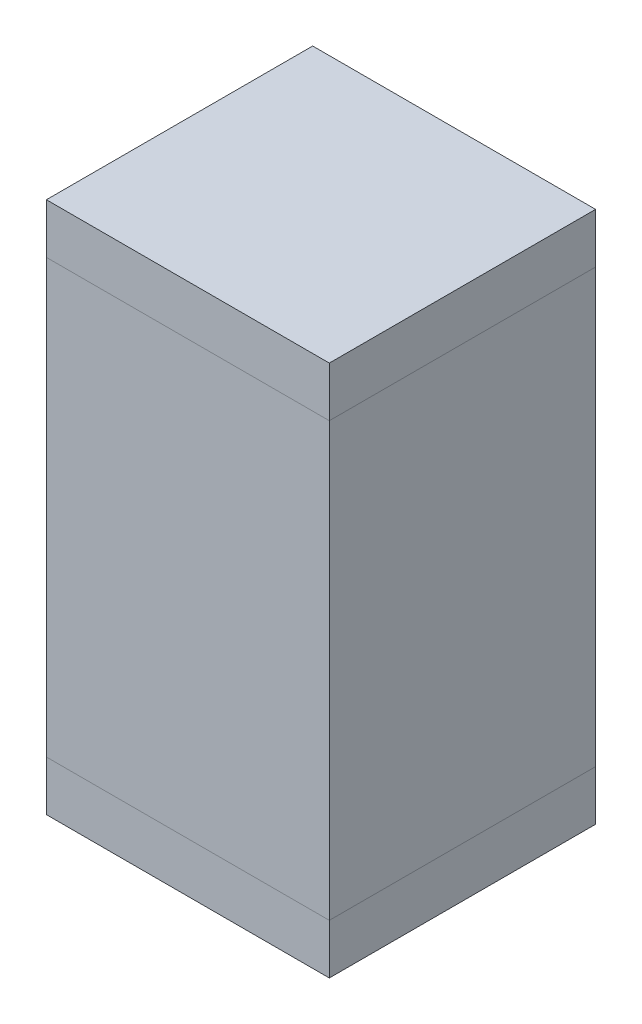
ISO-10303-21;
HEADER;
FILE_DESCRIPTION(('STEP AP214'),'2;1');
FILE_NAME('part.step','',(''),(''),'','','');
FILE_SCHEMA(('AUTOMOTIVE_DESIGN { 1 0 10303 214 1 1 1 1 }'));
ENDSEC;
DATA;
#1=APPLICATION_CONTEXT('core data for automotive mechanical design processes');
#2=APPLICATION_PROTOCOL_DEFINITION('international standard','automotive_design',2000,#1);
#3=PRODUCT_CONTEXT('',#1,'mechanical');
#4=PRODUCT('Part','Part','',(#3));
#5=PRODUCT_RELATED_PRODUCT_CATEGORY('part','',(#4));
#6=PRODUCT_DEFINITION_FORMATION('','',#4);
#7=PRODUCT_DEFINITION_CONTEXT('part definition',#1,'design');
#8=PRODUCT_DEFINITION('design','',#6,#7);
#9=PRODUCT_DEFINITION_SHAPE('','',#8);
#10=(LENGTH_UNIT() NAMED_UNIT(*) SI_UNIT(.MILLI.,.METRE.));
#11=(NAMED_UNIT(*) PLANE_ANGLE_UNIT() SI_UNIT($,.RADIAN.));
#12=(NAMED_UNIT(*) SI_UNIT($,.STERADIAN.) SOLID_ANGLE_UNIT());
#13=UNCERTAINTY_MEASURE_WITH_UNIT(LENGTH_MEASURE(1.E-05),#10,'distance_accuracy_value','');
#14=(GEOMETRIC_REPRESENTATION_CONTEXT(3) GLOBAL_UNCERTAINTY_ASSIGNED_CONTEXT((#13)) GLOBAL_UNIT_ASSIGNED_CONTEXT((#10,
#11,#12)) REPRESENTATION_CONTEXT('',''));
#15=CARTESIAN_POINT('',(0.,0.,0.));
#16=DIRECTION('',(0.,0.,1.));
#17=DIRECTION('',(1.,0.,0.));
#18=AXIS2_PLACEMENT_3D('',#15,#16,#17);
#19=CARTESIAN_POINT('',(0.,0.,0.));
#20=DIRECTION('',(0.,0.,1.));
#21=DIRECTION('',(1.,0.,0.));
#22=AXIS2_PLACEMENT_3D('',#19,#20,#21);
#23=PLANE('',#22);
#24=DIRECTION('',(1.,0.,0.));
#25=VECTOR('',#24,1.);
#26=CARTESIAN_POINT('',(-0.425,0.65,0.));
#27=LINE('',#26,#25);
#28=CARTESIAN_POINT('',(-0.425,0.65,0.));
#29=VERTEX_POINT('',#28);
#30=CARTESIAN_POINT('',(0.425,0.65,0.));
#31=VERTEX_POINT('',#30);
#32=EDGE_CURVE('P0_E26',#29,#31,#27,.T.);
#33=ORIENTED_EDGE('',*,*,#32,.T.);
#34=DIRECTION('',(0.,-1.,0.));
#35=VECTOR('',#34,1.);
#36=CARTESIAN_POINT('',(0.425,0.65,0.));
#37=LINE('',#36,#35);
#38=CARTESIAN_POINT('',(0.425,-0.65,0.));
#39=VERTEX_POINT('',#38);
#40=EDGE_CURVE('P0_E97',#31,#39,#37,.T.);
#41=ORIENTED_EDGE('',*,*,#40,.T.);
#42=DIRECTION('',(-1.,0.,0.));
#43=VECTOR('',#42,1.);
#44=CARTESIAN_POINT('',(0.425,-0.65,0.));
#45=LINE('',#44,#43);
#46=CARTESIAN_POINT('',(-0.425,-0.65,0.));
#47=VERTEX_POINT('',#46);
#48=EDGE_CURVE('P0_E83',#39,#47,#45,.T.);
#49=ORIENTED_EDGE('',*,*,#48,.T.);
#50=DIRECTION('',(0.,1.,0.));
#51=VECTOR('',#50,1.);
#52=CARTESIAN_POINT('',(-0.425,-0.65,0.));
#53=LINE('',#52,#51);
#54=EDGE_CURVE('P0_E67',#47,#29,#53,.T.);
#55=ORIENTED_EDGE('',*,*,#54,.T.);
#56=EDGE_LOOP('',(#33,#41,#49,#55));
#57=FACE_BOUND('',#56,.T.);
#58=ADVANCED_FACE('P0_F17',(#57),#23,.F.);
#59=CARTESIAN_POINT('',(0.,0.,0.8));
#60=DIRECTION('',(0.,0.,1.));
#61=DIRECTION('',(1.,0.,0.));
#62=AXIS2_PLACEMENT_3D('',#59,#60,#61);
#63=PLANE('',#62);
#64=DIRECTION('',(-1.,0.,0.));
#65=VECTOR('',#64,1.);
#66=CARTESIAN_POINT('',(-0.425,0.65,0.8));
#67=LINE('',#66,#65);
#68=CARTESIAN_POINT('',(0.425,0.65,0.8));
#69=VERTEX_POINT('',#68);
#70=CARTESIAN_POINT('',(-0.425,0.65,0.8));
#71=VERTEX_POINT('',#70);
#72=EDGE_CURVE('P0_E11',#69,#71,#67,.T.);
#73=ORIENTED_EDGE('',*,*,#72,.T.);
#74=DIRECTION('',(0.,-1.,0.));
#75=VECTOR('',#74,1.);
#76=CARTESIAN_POINT('',(-0.425,-0.65,0.8));
#77=LINE('',#76,#75);
#78=CARTESIAN_POINT('',(-0.425,-0.65,0.8));
#79=VERTEX_POINT('',#78);
#80=EDGE_CURVE('P0_E57',#71,#79,#77,.T.);
#81=ORIENTED_EDGE('',*,*,#80,.T.);
#82=DIRECTION('',(1.,0.,0.));
#83=VECTOR('',#82,1.);
#84=CARTESIAN_POINT('',(0.425,-0.65,0.8));
#85=LINE('',#84,#83);
#86=CARTESIAN_POINT('',(0.425,-0.65,0.8));
#87=VERTEX_POINT('',#86);
#88=EDGE_CURVE('P0_E61',#79,#87,#85,.T.);
#89=ORIENTED_EDGE('',*,*,#88,.T.);
#90=DIRECTION('',(0.,1.,0.));
#91=VECTOR('',#90,1.);
#92=CARTESIAN_POINT('',(0.425,0.65,0.8));
#93=LINE('',#92,#91);
#94=EDGE_CURVE('P0_E101',#87,#69,#93,.T.);
#95=ORIENTED_EDGE('',*,*,#94,.T.);
#96=EDGE_LOOP('',(#73,#81,#89,#95));
#97=FACE_BOUND('',#96,.T.);
#98=ADVANCED_FACE('P0_F59',(#97),#63,.T.);
#99=CARTESIAN_POINT('',(0.425,0.65,0.));
#100=DIRECTION('',(0.,1.,0.));
#101=DIRECTION('',(1.,0.,0.));
#102=AXIS2_PLACEMENT_3D('',#99,#100,#101);
#103=PLANE('',#102);
#104=ORIENTED_EDGE('',*,*,#32,.F.);
#105=DIRECTION('',(0.,0.,1.));
#106=VECTOR('',#105,1.);
#107=CARTESIAN_POINT('',(-0.425,0.65,0.));
#108=LINE('',#107,#106);
#109=EDGE_CURVE('P0_E66',#29,#71,#108,.T.);
#110=ORIENTED_EDGE('',*,*,#109,.T.);
#111=ORIENTED_EDGE('',*,*,#72,.F.);
#112=DIRECTION('',(0.,0.,1.));
#113=VECTOR('',#112,1.);
#114=CARTESIAN_POINT('',(0.425,0.65,0.));
#115=LINE('',#114,#113);
#116=EDGE_CURVE('P0_E105',#31,#69,#115,.T.);
#117=ORIENTED_EDGE('',*,*,#116,.F.);
#118=EDGE_LOOP('',(#104,#110,#111,#117));
#119=FACE_BOUND('',#118,.T.);
#120=ADVANCED_FACE('P0_F125',(#119),#103,.T.);
#121=CARTESIAN_POINT('',(-0.425,0.65,0.));
#122=DIRECTION('',(-1.,0.,0.));
#123=DIRECTION('',(0.,0.,1.));
#124=AXIS2_PLACEMENT_3D('',#121,#122,#123);
#125=PLANE('',#124);
#126=ORIENTED_EDGE('',*,*,#54,.F.);
#127=DIRECTION('',(0.,0.,1.));
#128=VECTOR('',#127,1.);
#129=CARTESIAN_POINT('',(-0.425,-0.65,0.));
#130=LINE('',#129,#128);
#131=EDGE_CURVE('P0_E70',#47,#79,#130,.T.);
#132=ORIENTED_EDGE('',*,*,#131,.T.);
#133=ORIENTED_EDGE('',*,*,#80,.F.);
#134=ORIENTED_EDGE('',*,*,#109,.F.);
#135=EDGE_LOOP('',(#126,#132,#133,#134));
#136=FACE_BOUND('',#135,.T.);
#137=ADVANCED_FACE('P0_F71',(#136),#125,.T.);
#138=CARTESIAN_POINT('',(-0.425,-0.65,0.));
#139=DIRECTION('',(0.,-1.,0.));
#140=DIRECTION('',(0.,0.,-1.));
#141=AXIS2_PLACEMENT_3D('',#138,#139,#140);
#142=PLANE('',#141);
#143=ORIENTED_EDGE('',*,*,#48,.F.);
#144=DIRECTION('',(0.,0.,1.));
#145=VECTOR('',#144,1.);
#146=CARTESIAN_POINT('',(0.425,-0.65,0.));
#147=LINE('',#146,#145);
#148=EDGE_CURVE('P0_E80',#39,#87,#147,.T.);
#149=ORIENTED_EDGE('',*,*,#148,.T.);
#150=ORIENTED_EDGE('',*,*,#88,.F.);
#151=ORIENTED_EDGE('',*,*,#131,.F.);
#152=EDGE_LOOP('',(#143,#149,#150,#151));
#153=FACE_BOUND('',#152,.T.);
#154=ADVANCED_FACE('P0_F78',(#153),#142,.T.);
#155=CARTESIAN_POINT('',(0.425,-0.65,0.));
#156=DIRECTION('',(1.,0.,0.));
#157=DIRECTION('',(0.,1.,0.));
#158=AXIS2_PLACEMENT_3D('',#155,#156,#157);
#159=PLANE('',#158);
#160=ORIENTED_EDGE('',*,*,#40,.F.);
#161=ORIENTED_EDGE('',*,*,#116,.T.);
#162=ORIENTED_EDGE('',*,*,#94,.F.);
#163=ORIENTED_EDGE('',*,*,#148,.F.);
#164=EDGE_LOOP('',(#160,#161,#162,#163));
#165=FACE_BOUND('',#164,.T.);
#166=ADVANCED_FACE('P0_F99',(#165),#159,.T.);
#167=CLOSED_SHELL('',(#58,#98,#120,#137,#154,#166));
#168=MANIFOLD_SOLID_BREP('P0_B1',#167);
#169=CARTESIAN_POINT('',(0.425,0.65,0.));
#170=DIRECTION('',(0.,1.,0.));
#171=DIRECTION('',(1.,0.,0.));
#172=AXIS2_PLACEMENT_3D('',#169,#170,#171);
#173=PLANE('',#172);
#174=DIRECTION('',(1.,0.,0.));
#175=VECTOR('',#174,1.);
#176=CARTESIAN_POINT('',(-0.425,0.65,0.));
#177=LINE('',#176,#175);
#178=CARTESIAN_POINT('',(-0.425,0.65,0.));
#179=VERTEX_POINT('',#178);
#180=CARTESIAN_POINT('',(0.425,0.65,0.));
#181=VERTEX_POINT('',#180);
#182=EDGE_CURVE('P1_E20',#179,#181,#177,.T.);
#183=ORIENTED_EDGE('',*,*,#182,.T.);
#184=DIRECTION('',(0.,0.,1.));
#185=VECTOR('',#184,1.);
#186=CARTESIAN_POINT('',(0.425,0.65,0.));
#187=LINE('',#186,#185);
#188=CARTESIAN_POINT('',(0.425,0.65,0.8));
#189=VERTEX_POINT('',#188);
#190=EDGE_CURVE('P1_E99',#181,#189,#187,.T.);
#191=ORIENTED_EDGE('',*,*,#190,.T.);
#192=DIRECTION('',(-1.,0.,0.));
#193=VECTOR('',#192,1.);
#194=CARTESIAN_POINT('',(-0.425,0.65,0.8));
#195=LINE('',#194,#193);
#196=CARTESIAN_POINT('',(-0.425,0.65,0.8));
#197=VERTEX_POINT('',#196);
#198=EDGE_CURVE('P1_E90',#189,#197,#195,.T.);
#199=ORIENTED_EDGE('',*,*,#198,.T.);
#200=DIRECTION('',(0.,0.,1.));
#201=VECTOR('',#200,1.);
#202=CARTESIAN_POINT('',(-0.425,0.65,0.));
#203=LINE('',#202,#201);
#204=EDGE_CURVE('P1_E66',#179,#197,#203,.T.);
#205=ORIENTED_EDGE('',*,*,#204,.F.);
#206=EDGE_LOOP('',(#183,#191,#199,#205));
#207=FACE_BOUND('',#206,.T.);
#208=ADVANCED_FACE('P1_F17',(#207),#173,.F.);
#209=CARTESIAN_POINT('',(0.425,0.8,0.));
#210=DIRECTION('',(0.,1.,0.));
#211=DIRECTION('',(1.,0.,0.));
#212=AXIS2_PLACEMENT_3D('',#209,#210,#211);
#213=PLANE('',#212);
#214=DIRECTION('',(-1.,0.,0.));
#215=VECTOR('',#214,1.);
#216=CARTESIAN_POINT('',(-0.425,0.8,0.));
#217=LINE('',#216,#215);
#218=CARTESIAN_POINT('',(0.425,0.8,0.));
#219=VERTEX_POINT('',#218);
#220=CARTESIAN_POINT('',(-0.425,0.8,0.));
#221=VERTEX_POINT('',#220);
#222=EDGE_CURVE('P1_E11',#219,#221,#217,.T.);
#223=ORIENTED_EDGE('',*,*,#222,.T.);
#224=DIRECTION('',(0.,0.,1.));
#225=VECTOR('',#224,1.);
#226=CARTESIAN_POINT('',(-0.425,0.8,0.));
#227=LINE('',#226,#225);
#228=CARTESIAN_POINT('',(-0.425,0.8,0.8));
#229=VERTEX_POINT('',#228);
#230=EDGE_CURVE('P1_E71',#221,#229,#227,.T.);
#231=ORIENTED_EDGE('',*,*,#230,.T.);
#232=DIRECTION('',(1.,0.,0.));
#233=VECTOR('',#232,1.);
#234=CARTESIAN_POINT('',(-0.425,0.8,0.8));
#235=LINE('',#234,#233);
#236=CARTESIAN_POINT('',(0.425,0.8,0.8));
#237=VERTEX_POINT('',#236);
#238=EDGE_CURVE('P1_E74',#229,#237,#235,.T.);
#239=ORIENTED_EDGE('',*,*,#238,.T.);
#240=DIRECTION('',(0.,0.,-1.));
#241=VECTOR('',#240,1.);
#242=CARTESIAN_POINT('',(0.425,0.8,0.));
#243=LINE('',#242,#241);
#244=EDGE_CURVE('P1_E102',#237,#219,#243,.T.);
#245=ORIENTED_EDGE('',*,*,#244,.T.);
#246=EDGE_LOOP('',(#223,#231,#239,#245));
#247=FACE_BOUND('',#246,.T.);
#248=ADVANCED_FACE('P1_F72',(#247),#213,.T.);
#249=CARTESIAN_POINT('',(0.425,0.65,0.));
#250=DIRECTION('',(0.,0.,-1.));
#251=DIRECTION('',(0.,-1.,0.));
#252=AXIS2_PLACEMENT_3D('',#249,#250,#251);
#253=PLANE('',#252);
#254=ORIENTED_EDGE('',*,*,#182,.F.);
#255=DIRECTION('',(0.,1.,0.));
#256=VECTOR('',#255,1.);
#257=CARTESIAN_POINT('',(-0.425,0.65,0.));
#258=LINE('',#257,#256);
#259=EDGE_CURVE('P1_E77',#179,#221,#258,.T.);
#260=ORIENTED_EDGE('',*,*,#259,.T.);
#261=ORIENTED_EDGE('',*,*,#222,.F.);
#262=DIRECTION('',(0.,1.,0.));
#263=VECTOR('',#262,1.);
#264=CARTESIAN_POINT('',(0.425,0.65,0.));
#265=LINE('',#264,#263);
#266=EDGE_CURVE('P1_E100',#181,#219,#265,.T.);
#267=ORIENTED_EDGE('',*,*,#266,.F.);
#268=EDGE_LOOP('',(#254,#260,#261,#267));
#269=FACE_BOUND('',#268,.T.);
#270=ADVANCED_FACE('P1_F119',(#269),#253,.T.);
#271=CARTESIAN_POINT('',(-0.425,0.65,0.));
#272=DIRECTION('',(-1.,0.,0.));
#273=DIRECTION('',(0.,0.,1.));
#274=AXIS2_PLACEMENT_3D('',#271,#272,#273);
#275=PLANE('',#274);
#276=ORIENTED_EDGE('',*,*,#204,.T.);
#277=DIRECTION('',(0.,1.,0.));
#278=VECTOR('',#277,1.);
#279=CARTESIAN_POINT('',(-0.425,0.65,0.8));
#280=LINE('',#279,#278);
#281=EDGE_CURVE('P1_E79',#197,#229,#280,.T.);
#282=ORIENTED_EDGE('',*,*,#281,.T.);
#283=ORIENTED_EDGE('',*,*,#230,.F.);
#284=ORIENTED_EDGE('',*,*,#259,.F.);
#285=EDGE_LOOP('',(#276,#282,#283,#284));
#286=FACE_BOUND('',#285,.T.);
#287=ADVANCED_FACE('P1_F80',(#286),#275,.T.);
#288=CARTESIAN_POINT('',(-0.425,0.65,0.8));
#289=DIRECTION('',(0.,0.,1.));
#290=DIRECTION('',(1.,0.,0.));
#291=AXIS2_PLACEMENT_3D('',#288,#289,#290);
#292=PLANE('',#291);
#293=ORIENTED_EDGE('',*,*,#198,.F.);
#294=DIRECTION('',(0.,1.,0.));
#295=VECTOR('',#294,1.);
#296=CARTESIAN_POINT('',(0.425,0.65,0.8));
#297=LINE('',#296,#295);
#298=EDGE_CURVE('P1_E87',#189,#237,#297,.T.);
#299=ORIENTED_EDGE('',*,*,#298,.T.);
#300=ORIENTED_EDGE('',*,*,#238,.F.);
#301=ORIENTED_EDGE('',*,*,#281,.F.);
#302=EDGE_LOOP('',(#293,#299,#300,#301));
#303=FACE_BOUND('',#302,.T.);
#304=ADVANCED_FACE('P1_F85',(#303),#292,.T.);
#305=CARTESIAN_POINT('',(0.425,0.65,0.8));
#306=DIRECTION('',(1.,0.,0.));
#307=DIRECTION('',(0.,1.,0.));
#308=AXIS2_PLACEMENT_3D('',#305,#306,#307);
#309=PLANE('',#308);
#310=ORIENTED_EDGE('',*,*,#190,.F.);
#311=ORIENTED_EDGE('',*,*,#266,.T.);
#312=ORIENTED_EDGE('',*,*,#244,.F.);
#313=ORIENTED_EDGE('',*,*,#298,.F.);
#314=EDGE_LOOP('',(#310,#311,#312,#313));
#315=FACE_BOUND('',#314,.T.);
#316=ADVANCED_FACE('P1_F121',(#315),#309,.T.);
#317=CLOSED_SHELL('',(#208,#248,#270,#287,#304,#316));
#318=MANIFOLD_SOLID_BREP('P1_B1',#317);
#319=CARTESIAN_POINT('',(-0.425,-0.65,0.));
#320=DIRECTION('',(0.,-1.,0.));
#321=DIRECTION('',(0.,0.,-1.));
#322=AXIS2_PLACEMENT_3D('',#319,#320,#321);
#323=PLANE('',#322);
#324=DIRECTION('',(-1.,0.,0.));
#325=VECTOR('',#324,1.);
#326=CARTESIAN_POINT('',(0.425,-0.65,0.));
#327=LINE('',#326,#325);
#328=CARTESIAN_POINT('',(0.425,-0.65,0.));
#329=VERTEX_POINT('',#328);
#330=CARTESIAN_POINT('',(-0.425,-0.65,0.));
#331=VERTEX_POINT('',#330);
#332=EDGE_CURVE('P2_E26',#329,#331,#327,.T.);
#333=ORIENTED_EDGE('',*,*,#332,.T.);
#334=DIRECTION('',(0.,0.,1.));
#335=VECTOR('',#334,1.);
#336=CARTESIAN_POINT('',(-0.425,-0.65,0.));
#337=LINE('',#336,#335);
#338=CARTESIAN_POINT('',(-0.425,-0.65,0.8));
#339=VERTEX_POINT('',#338);
#340=EDGE_CURVE('P2_E73',#331,#339,#337,.T.);
#341=ORIENTED_EDGE('',*,*,#340,.T.);
#342=DIRECTION('',(1.,0.,0.));
#343=VECTOR('',#342,1.);
#344=CARTESIAN_POINT('',(0.425,-0.65,0.8));
#345=LINE('',#344,#343);
#346=CARTESIAN_POINT('',(0.425,-0.65,0.8));
#347=VERTEX_POINT('',#346);
#348=EDGE_CURVE('P2_E99',#339,#347,#345,.T.);
#349=ORIENTED_EDGE('',*,*,#348,.T.);
#350=DIRECTION('',(0.,0.,1.));
#351=VECTOR('',#350,1.);
#352=CARTESIAN_POINT('',(0.425,-0.65,0.));
#353=LINE('',#352,#351);
#354=EDGE_CURVE('P2_E74',#329,#347,#353,.T.);
#355=ORIENTED_EDGE('',*,*,#354,.F.);
#356=EDGE_LOOP('',(#333,#341,#349,#355));
#357=FACE_BOUND('',#356,.T.);
#358=ADVANCED_FACE('P2_F17',(#357),#323,.F.);
#359=CARTESIAN_POINT('',(-0.425,-0.8,0.));
#360=DIRECTION('',(0.,-1.,0.));
#361=DIRECTION('',(0.,0.,-1.));
#362=AXIS2_PLACEMENT_3D('',#359,#360,#361);
#363=PLANE('',#362);
#364=DIRECTION('',(1.,0.,0.));
#365=VECTOR('',#364,1.);
#366=CARTESIAN_POINT('',(0.425,-0.8,0.));
#367=LINE('',#366,#365);
#368=CARTESIAN_POINT('',(-0.425,-0.8,0.));
#369=VERTEX_POINT('',#368);
#370=CARTESIAN_POINT('',(0.425,-0.8,0.));
#371=VERTEX_POINT('',#370);
#372=EDGE_CURVE('P2_E11',#369,#371,#367,.T.);
#373=ORIENTED_EDGE('',*,*,#372,.T.);
#374=DIRECTION('',(0.,0.,1.));
#375=VECTOR('',#374,1.);
#376=CARTESIAN_POINT('',(0.425,-0.8,0.));
#377=LINE('',#376,#375);
#378=CARTESIAN_POINT('',(0.425,-0.8,0.8));
#379=VERTEX_POINT('',#378);
#380=EDGE_CURVE('P2_E20',#371,#379,#377,.T.);
#381=ORIENTED_EDGE('',*,*,#380,.T.);
#382=DIRECTION('',(-1.,0.,0.));
#383=VECTOR('',#382,1.);
#384=CARTESIAN_POINT('',(0.425,-0.8,0.8));
#385=LINE('',#384,#383);
#386=CARTESIAN_POINT('',(-0.425,-0.8,0.8));
#387=VERTEX_POINT('',#386);
#388=EDGE_CURVE('P2_E102',#379,#387,#385,.T.);
#389=ORIENTED_EDGE('',*,*,#388,.T.);
#390=DIRECTION('',(0.,0.,-1.));
#391=VECTOR('',#390,1.);
#392=CARTESIAN_POINT('',(-0.425,-0.8,0.));
#393=LINE('',#392,#391);
#394=EDGE_CURVE('P2_E83',#387,#369,#393,.T.);
#395=ORIENTED_EDGE('',*,*,#394,.T.);
#396=EDGE_LOOP('',(#373,#381,#389,#395));
#397=FACE_BOUND('',#396,.T.);
#398=ADVANCED_FACE('P2_F117',(#397),#363,.T.);
#399=CARTESIAN_POINT('',(-0.425,-0.65,0.));
#400=DIRECTION('',(0.,0.,-1.));
#401=DIRECTION('',(0.,-1.,0.));
#402=AXIS2_PLACEMENT_3D('',#399,#400,#401);
#403=PLANE('',#402);
#404=ORIENTED_EDGE('',*,*,#332,.F.);
#405=DIRECTION('',(0.,-1.,0.));
#406=VECTOR('',#405,1.);
#407=CARTESIAN_POINT('',(0.425,-0.65,0.));
#408=LINE('',#407,#406);
#409=EDGE_CURVE('P2_E76',#329,#371,#408,.T.);
#410=ORIENTED_EDGE('',*,*,#409,.T.);
#411=ORIENTED_EDGE('',*,*,#372,.F.);
#412=DIRECTION('',(0.,-1.,0.));
#413=VECTOR('',#412,1.);
#414=CARTESIAN_POINT('',(-0.425,-0.65,0.));
#415=LINE('',#414,#413);
#416=EDGE_CURVE('P2_E78',#331,#369,#415,.T.);
#417=ORIENTED_EDGE('',*,*,#416,.F.);
#418=EDGE_LOOP('',(#404,#410,#411,#417));
#419=FACE_BOUND('',#418,.T.);
#420=ADVANCED_FACE('P2_F79',(#419),#403,.T.);
#421=CARTESIAN_POINT('',(0.425,-0.65,0.));
#422=DIRECTION('',(1.,0.,0.));
#423=DIRECTION('',(0.,1.,0.));
#424=AXIS2_PLACEMENT_3D('',#421,#422,#423);
#425=PLANE('',#424);
#426=ORIENTED_EDGE('',*,*,#354,.T.);
#427=DIRECTION('',(0.,-1.,0.));
#428=VECTOR('',#427,1.);
#429=CARTESIAN_POINT('',(0.425,-0.65,0.8));
#430=LINE('',#429,#428);
#431=EDGE_CURVE('P2_E105',#347,#379,#430,.T.);
#432=ORIENTED_EDGE('',*,*,#431,.T.);
#433=ORIENTED_EDGE('',*,*,#380,.F.);
#434=ORIENTED_EDGE('',*,*,#409,.F.);
#435=EDGE_LOOP('',(#426,#432,#433,#434));
#436=FACE_BOUND('',#435,.T.);
#437=ADVANCED_FACE('P2_F119',(#436),#425,.T.);
#438=CARTESIAN_POINT('',(0.425,-0.65,0.8));
#439=DIRECTION('',(0.,0.,1.));
#440=DIRECTION('',(1.,0.,0.));
#441=AXIS2_PLACEMENT_3D('',#438,#439,#440);
#442=PLANE('',#441);
#443=ORIENTED_EDGE('',*,*,#348,.F.);
#444=DIRECTION('',(0.,-1.,0.));
#445=VECTOR('',#444,1.);
#446=CARTESIAN_POINT('',(-0.425,-0.65,0.8));
#447=LINE('',#446,#445);
#448=EDGE_CURVE('P2_E88',#339,#387,#447,.T.);
#449=ORIENTED_EDGE('',*,*,#448,.T.);
#450=ORIENTED_EDGE('',*,*,#388,.F.);
#451=ORIENTED_EDGE('',*,*,#431,.F.);
#452=EDGE_LOOP('',(#443,#449,#450,#451));
#453=FACE_BOUND('',#452,.T.);
#454=ADVANCED_FACE('P2_F121',(#453),#442,.T.);
#455=CARTESIAN_POINT('',(-0.425,-0.65,0.8));
#456=DIRECTION('',(-1.,0.,0.));
#457=DIRECTION('',(0.,0.,1.));
#458=AXIS2_PLACEMENT_3D('',#455,#456,#457);
#459=PLANE('',#458);
#460=ORIENTED_EDGE('',*,*,#340,.F.);
#461=ORIENTED_EDGE('',*,*,#416,.T.);
#462=ORIENTED_EDGE('',*,*,#394,.F.);
#463=ORIENTED_EDGE('',*,*,#448,.F.);
#464=EDGE_LOOP('',(#460,#461,#462,#463));
#465=FACE_BOUND('',#464,.T.);
#466=ADVANCED_FACE('P2_F86',(#465),#459,.T.);
#467=CLOSED_SHELL('',(#358,#398,#420,#437,#454,#466));
#468=MANIFOLD_SOLID_BREP('P2_B1',#467);
#469=ADVANCED_BREP_SHAPE_REPRESENTATION('',(#18,#168,#318,#468),#14);
#470=SHAPE_DEFINITION_REPRESENTATION(#9,#469);
ENDSEC;
END-ISO-10303-21;
